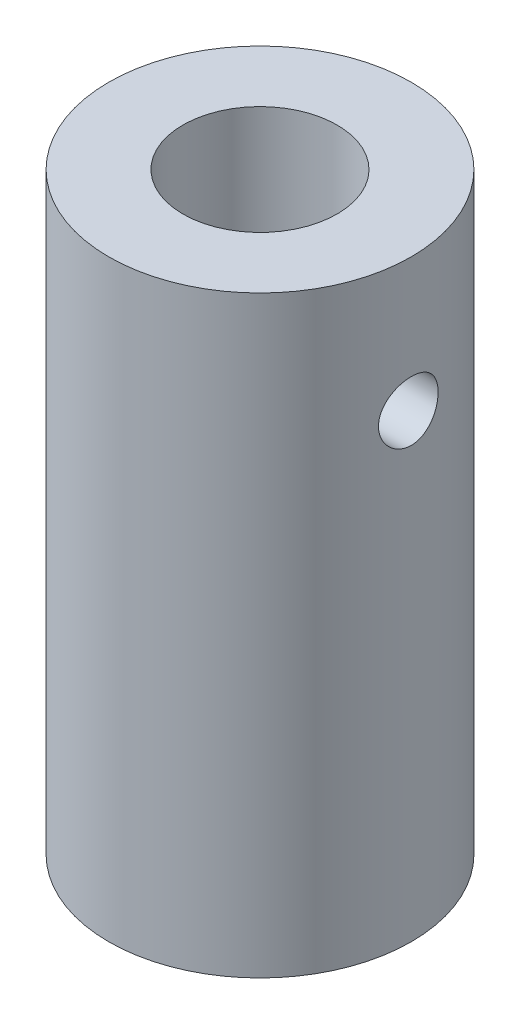
ISO-10303-21;
HEADER;
FILE_DESCRIPTION(('STEP AP214'),'2;1');
FILE_NAME('part.step','',(''),(''),'','','');
FILE_SCHEMA(('AUTOMOTIVE_DESIGN { 1 0 10303 214 1 1 1 1 }'));
ENDSEC;
DATA;
#1=APPLICATION_CONTEXT('core data for automotive mechanical design processes');
#2=APPLICATION_PROTOCOL_DEFINITION('international standard','automotive_design',2000,#1);
#3=PRODUCT_CONTEXT('',#1,'mechanical');
#4=PRODUCT('Part','Part','',(#3));
#5=PRODUCT_RELATED_PRODUCT_CATEGORY('part','',(#4));
#6=PRODUCT_DEFINITION_FORMATION('','',#4);
#7=PRODUCT_DEFINITION_CONTEXT('part definition',#1,'design');
#8=PRODUCT_DEFINITION('design','',#6,#7);
#9=PRODUCT_DEFINITION_SHAPE('','',#8);
#10=(LENGTH_UNIT() NAMED_UNIT(*) SI_UNIT(.MILLI.,.METRE.));
#11=(NAMED_UNIT(*) PLANE_ANGLE_UNIT() SI_UNIT($,.RADIAN.));
#12=(NAMED_UNIT(*) SI_UNIT($,.STERADIAN.) SOLID_ANGLE_UNIT());
#13=UNCERTAINTY_MEASURE_WITH_UNIT(LENGTH_MEASURE(1.E-05),#10,'distance_accuracy_value','');
#14=(GEOMETRIC_REPRESENTATION_CONTEXT(3) GLOBAL_UNCERTAINTY_ASSIGNED_CONTEXT((#13)) GLOBAL_UNIT_ASSIGNED_CONTEXT((#10,
#11,#12)) REPRESENTATION_CONTEXT('',''));
#15=CARTESIAN_POINT('',(0.,0.,0.));
#16=DIRECTION('',(0.,0.,1.));
#17=DIRECTION('',(1.,0.,0.));
#18=AXIS2_PLACEMENT_3D('',#15,#16,#17);
#19=CARTESIAN_POINT('',(0.,50.8,0.));
#20=DIRECTION('',(0.,1.,0.));
#21=DIRECTION('',(0.,0.,1.));
#22=AXIS2_PLACEMENT_3D('',#19,#20,#21);
#23=PLANE('',#22);
#24=CARTESIAN_POINT('',(0.,50.8,0.));
#25=DIRECTION('',(0.,1.,0.));
#26=DIRECTION('',(0.,0.,1.));
#27=AXIS2_PLACEMENT_3D('',#24,#25,#26);
#28=CIRCLE('',#27,12.954);
#29=CARTESIAN_POINT('',(0.,50.8,12.954));
#30=VERTEX_POINT('',#29);
#31=EDGE_CURVE('E10',#30,#30,#28,.T.);
#32=ORIENTED_EDGE('',*,*,#31,.T.);
#33=EDGE_LOOP('',(#32));
#34=FACE_BOUND('',#33,.T.);
#35=CARTESIAN_POINT('',(0.,50.8,0.));
#36=DIRECTION('',(0.,1.,0.));
#37=DIRECTION('',(0.,0.,1.));
#38=AXIS2_PLACEMENT_3D('',#35,#36,#37);
#39=CIRCLE('',#38,6.604);
#40=CARTESIAN_POINT('',(0.,50.8,6.604));
#41=VERTEX_POINT('',#40);
#42=EDGE_CURVE('E61',#41,#41,#39,.T.);
#43=ORIENTED_EDGE('',*,*,#42,.F.);
#44=EDGE_LOOP('',(#43));
#45=FACE_BOUND('',#44,.T.);
#46=ADVANCED_FACE('F47',(#34,#45),#23,.T.);
#47=CARTESIAN_POINT('',(0.,0.,0.));
#48=DIRECTION('',(0.,1.,0.));
#49=DIRECTION('',(0.,0.,1.));
#50=AXIS2_PLACEMENT_3D('',#47,#48,#49);
#51=PLANE('',#50);
#52=CARTESIAN_POINT('',(0.,0.,0.));
#53=DIRECTION('',(0.,1.,0.));
#54=DIRECTION('',(0.,0.,1.));
#55=AXIS2_PLACEMENT_3D('',#52,#53,#54);
#56=CIRCLE('',#55,12.954);
#57=CARTESIAN_POINT('',(0.,0.,12.954));
#58=VERTEX_POINT('',#57);
#59=EDGE_CURVE('E51',#58,#58,#56,.T.);
#60=ORIENTED_EDGE('',*,*,#59,.F.);
#61=EDGE_LOOP('',(#60));
#62=FACE_BOUND('',#61,.T.);
#63=CARTESIAN_POINT('',(0.,0.,0.));
#64=DIRECTION('',(0.,1.,0.));
#65=DIRECTION('',(0.,0.,1.));
#66=AXIS2_PLACEMENT_3D('',#63,#64,#65);
#67=CIRCLE('',#66,6.604);
#68=CARTESIAN_POINT('',(0.,0.,6.604));
#69=VERTEX_POINT('',#68);
#70=EDGE_CURVE('E63',#69,#69,#67,.T.);
#71=ORIENTED_EDGE('',*,*,#70,.T.);
#72=EDGE_LOOP('',(#71));
#73=FACE_BOUND('',#72,.T.);
#74=ADVANCED_FACE('F99',(#62,#73),#51,.F.);
#75=CARTESIAN_POINT('',(0.,50.8,0.));
#76=DIRECTION('',(0.,-1.,0.));
#77=DIRECTION('',(0.,0.,-1.));
#78=AXIS2_PLACEMENT_3D('',#75,#76,#77);
#79=CYLINDRICAL_SURFACE('',#78,12.954);
#80=CARTESIAN_POINT('',(12.6999936499984,39.37,2.5527));
#81=CARTESIAN_POINT('',(12.6999964560656,39.5118846038993,2.55269470529488));
#82=CARTESIAN_POINT('',(12.7023972007292,39.6538363709703,2.54083045244426));
#83=CARTESIAN_POINT('',(12.711727198339,39.9337273193116,2.49372464143787));
#84=CARTESIAN_POINT('',(12.7186601271798,40.071663148459,2.45846410703602));
#85=CARTESIAN_POINT('',(12.7362394967447,40.3394323066131,2.36569894641199));
#86=CARTESIAN_POINT('',(12.7468822994527,40.4692734270284,2.3082161060649));
#87=CARTESIAN_POINT('',(12.7706779198386,40.7174641353506,2.17269724505164));
#88=CARTESIAN_POINT('',(12.783830584046,40.8358144252202,2.09466248096343));
#89=CARTESIAN_POINT('',(12.8113657262031,41.0592959784291,1.91911261103482));
#90=CARTESIAN_POINT('',(12.8257613551746,41.1642464900658,1.82136942807505));
#91=CARTESIAN_POINT('',(12.8540445578265,41.3563720946631,1.60967010492994));
#92=CARTESIAN_POINT('',(12.8679320963932,41.4435459609883,1.49571284685128));
#93=CARTESIAN_POINT('',(12.8937759771519,41.598343015845,1.25362558079212));
#94=CARTESIAN_POINT('',(12.9057150074278,41.6657947601989,1.12538394028595));
#95=CARTESIAN_POINT('',(12.9261690621922,41.7781269800485,0.859113331705537));
#96=CARTESIAN_POINT('',(12.9346843977458,41.8230095061994,0.721085254134684));
#97=CARTESIAN_POINT('',(12.9472387117929,41.8883674635948,0.441035057662935));
#98=CARTESIAN_POINT('',(12.9513336004,41.9091479952259,0.29908669096931));
#99=CARTESIAN_POINT('',(12.9547786408718,41.926663678721,0.0136632800686853));
#100=CARTESIAN_POINT('',(12.9541292371467,41.9234010827667,-0.129811619886808));
#101=CARTESIAN_POINT('',(12.9482022753918,41.8931551538447,-0.412119865872245));
#102=CARTESIAN_POINT('',(12.9429888352255,41.8665004323829,-0.550989960317775));
#103=CARTESIAN_POINT('',(12.9285917985172,41.7907477457311,-0.822246914749961));
#104=CARTESIAN_POINT('',(12.9194080464398,41.7416489012967,-0.954633520522146));
#105=CARTESIAN_POINT('',(12.8979962445554,41.6220951903056,-1.2101067652594));
#106=CARTESIAN_POINT('',(12.8857498352859,41.5515109518044,-1.33313126044891));
#107=CARTESIAN_POINT('',(12.8595637882297,41.3910857126889,-1.56571168746213));
#108=CARTESIAN_POINT('',(12.8456239611097,41.3012425579619,-1.67526611049739));
#109=CARTESIAN_POINT('',(12.8173134588381,41.1030451135238,-1.87974593617272));
#110=CARTESIAN_POINT('',(12.8029394847352,40.9944032553083,-1.97439235586856));
#111=CARTESIAN_POINT('',(12.775604938468,40.7626449639737,-2.14416676141107));
#112=CARTESIAN_POINT('',(12.7626443915042,40.6395282728606,-2.21929439928557));
#113=CARTESIAN_POINT('',(12.7395980543948,40.3819219011779,-2.34799082660807));
#114=CARTESIAN_POINT('',(12.7295181499613,40.2474096536186,-2.40151556779307));
#115=CARTESIAN_POINT('',(12.7134615964999,39.9710569493192,-2.48512393860867));
#116=CARTESIAN_POINT('',(12.7074844296736,39.8292174197715,-2.51521052638726));
#117=CARTESIAN_POINT('',(12.7004135327466,39.5447619057547,-2.5506739071257));
#118=CARTESIAN_POINT('',(12.6992402886649,39.4021980082035,-2.55645307787584));
#119=CARTESIAN_POINT('',(12.7016967998167,39.118143008791,-2.54421933773806));
#120=CARTESIAN_POINT('',(12.705326291143,38.9766518484131,-2.52620773413736));
#121=CARTESIAN_POINT('',(12.7169049541452,38.7001040816553,-2.46725027235019));
#122=CARTESIAN_POINT('',(12.7248137949063,38.5650000069211,-2.42651843299844));
#123=CARTESIAN_POINT('',(12.7440248133199,38.3035339393909,-2.32350514279095));
#124=CARTESIAN_POINT('',(12.7553272635043,38.1771726497085,-2.26122196114165));
#125=CARTESIAN_POINT('',(12.780231221071,37.9350155031722,-2.11595946421157));
#126=CARTESIAN_POINT('',(12.7938600574193,37.8193738926915,-2.03272779151052));
#127=CARTESIAN_POINT('',(12.8218057253165,37.6035522990143,-1.84826828051531));
#128=CARTESIAN_POINT('',(12.836122625406,37.5033738603653,-1.74703864665502));
#129=CARTESIAN_POINT('',(12.8640887181811,37.3198020866866,-1.52765261367294));
#130=CARTESIAN_POINT('',(12.8777248180054,37.236680467357,-1.40926691821333));
#131=CARTESIAN_POINT('',(12.9025670030226,37.0915068065751,-1.15997764592574));
#132=CARTESIAN_POINT('',(12.9137731883081,37.0294538972054,-1.02907458503057));
#133=CARTESIAN_POINT('',(12.9324369088285,36.9285777355193,-0.759189484808883));
#134=CARTESIAN_POINT('',(12.9399152469174,36.8896253365008,-0.620257219565459));
#135=CARTESIAN_POINT('',(12.9503697771678,36.8356459785038,-0.337659988307553));
#136=CARTESIAN_POINT('',(12.9533464949998,36.8206162259794,-0.193995576885377));
#137=CARTESIAN_POINT('',(12.9544504356144,36.8150143643972,0.0913900104214483));
#138=CARTESIAN_POINT('',(12.9526587483563,36.8240332961505,0.233103005005912));
#139=CARTESIAN_POINT('',(12.9445972082044,36.8653715667451,0.512951899858711));
#140=CARTESIAN_POINT('',(12.9383274082796,36.8976906299818,0.651087842418041));
#141=CARTESIAN_POINT('',(12.9220158544874,36.9845322143373,0.919615930903082));
#142=CARTESIAN_POINT('',(12.911982223707,37.0390069403518,1.05002405810271));
#143=CARTESIAN_POINT('',(12.8892247597301,37.1685624806085,1.2999083253577));
#144=CARTESIAN_POINT('',(12.8765007215965,37.2436448647333,1.41938363163051));
#145=CARTESIAN_POINT('',(12.8495107406611,37.4136707178677,1.64603672705227));
#146=CARTESIAN_POINT('',(12.8352237285662,37.5089074641959,1.75299202749085));
#147=CARTESIAN_POINT('',(12.8068450323962,37.7159345748501,1.94954408581376));
#148=CARTESIAN_POINT('',(12.7927533952898,37.8277288466939,2.03913673462033));
#149=CARTESIAN_POINT('',(12.7661998829505,38.0660914332319,2.19930312367454));
#150=CARTESIAN_POINT('',(12.7537564796432,38.1928012949769,2.26966939593184));
#151=CARTESIAN_POINT('',(12.7321331027171,38.4564540821596,2.38800128130351));
#152=CARTESIAN_POINT('',(12.7229501415081,38.5933874996025,2.43598741437484));
#153=CARTESIAN_POINT('',(12.7107401829196,38.8372116673781,2.49878370236449));
#154=CARTESIAN_POINT('',(12.7067349563873,38.9427026033387,2.51896650723778));
#155=CARTESIAN_POINT('',(12.7013606719411,39.1554495955357,2.54592643933515));
#156=CARTESIAN_POINT('',(12.6999915280253,39.2627055940721,2.55270400390334));
#157=CARTESIAN_POINT('',(12.6999936499984,39.37,2.5527));
#158=B_SPLINE_CURVE_WITH_KNOTS('',3,(#80,#81,#82,#83,#84,#85,#86,#87,#88,#89,#90,#91,#92,#93,
#94,#95,#96,#97,#98,#99,#100,#101,#102,#103,#104,#105,#106,#107,#108,#109,#110,#111,#112,#113,
#114,#115,#116,#117,#118,#119,#120,#121,#122,#123,#124,#125,#126,#127,#128,#129,#130,#131,#132,
#133,#134,#135,#136,#137,#138,#139,#140,#141,#142,#143,#144,#145,#146,#147,#148,#149,#150,#151,
#152,#153,#154,#155,#156,#157),.UNSPECIFIED.,.T.,.F.,(4,2,2,2,2,2,2,2,2,2,2,2,2,2,2,2,2,2,2,2,2,
2,2,2,2,2,2,2,2,2,2,2,2,2,2,2,2,2,4),(0.,0.425261007666672,0.850867358163517,1.27605751472451,
1.70122168050208,2.13162201908685,2.56205204638439,2.9961195455948,3.43014759799418,
3.85861928655146,4.28705083957021,4.70955844948326,5.13208261247473,5.55720304823211,
5.98237105861164,6.41473513711059,6.84710692307495,7.28035591369378,7.71355021475017,
8.13954461366788,8.56551560545061,8.98754021680916,9.40959872893701,9.83700771735127,
10.2644593701634,10.6982665816013,11.1320559203502,11.5633966594628,11.9946870254441,
12.4186900669991,12.8426880933334,13.2657762646093,13.6888966755094,14.1186592390795,
14.5485233871912,14.9828577313365,15.4167930552262,15.73838972331,16.0599758991737),.UNSPECIFIED.);
#159=CARTESIAN_POINT('',(12.6999936499984,39.37,2.5527));
#160=VERTEX_POINT('',#159);
#161=EDGE_CURVE('E79',#160,#160,#158,.T.);
#162=ORIENTED_EDGE('',*,*,#161,.T.);
#163=EDGE_LOOP('',(#162));
#164=FACE_BOUND('',#163,.T.);
#165=ORIENTED_EDGE('',*,*,#31,.F.);
#166=EDGE_LOOP('',(#165));
#167=FACE_BOUND('',#166,.T.);
#168=ORIENTED_EDGE('',*,*,#59,.T.);
#169=EDGE_LOOP('',(#168));
#170=FACE_BOUND('',#169,.T.);
#171=ADVANCED_FACE('F49',(#164,#167,#170),#79,.T.);
#172=CARTESIAN_POINT('',(0.,50.8,0.));
#173=DIRECTION('',(0.,-1.,0.));
#174=DIRECTION('',(0.,0.,-1.));
#175=AXIS2_PLACEMENT_3D('',#172,#173,#174);
#176=CYLINDRICAL_SURFACE('',#175,6.604);
#177=CARTESIAN_POINT('',(6.09069279392747,39.37,2.5527));
#178=CARTESIAN_POINT('',(6.09068621282821,39.5075038315529,2.55270681708154));
#179=CARTESIAN_POINT('',(6.09539960938205,39.6449644848225,2.54155315657549));
#180=CARTESIAN_POINT('',(6.11360032490419,39.9157209334737,2.49745315471047));
#181=CARTESIAN_POINT('',(6.12708697395381,40.049017046042,2.4645084772932));
#182=CARTESIAN_POINT('',(6.16108304331434,40.3074505314335,2.3782326648086));
#183=CARTESIAN_POINT('',(6.18157466982632,40.4326076291685,2.32495314404245));
#184=CARTESIAN_POINT('',(6.2272422726624,40.6722566550951,2.19970442142836));
#185=CARTESIAN_POINT('',(6.25241974380341,40.7867451623935,2.12772925263199));
#186=CARTESIAN_POINT('',(6.30611326198978,41.0078617337476,1.96305645407738));
#187=CARTESIAN_POINT('',(6.33473164494139,41.1138468028968,1.869528577533));
#188=CARTESIAN_POINT('',(6.39123170912992,41.3090852430119,1.66616381683389));
#189=CARTESIAN_POINT('',(6.41911321902346,41.3983347513964,1.55632317813711));
#190=CARTESIAN_POINT('',(6.47222405707365,41.5607208728981,1.31851673394261));
#191=CARTESIAN_POINT('',(6.49731955217189,41.633151026134,1.19003594680584));
#192=CARTESIAN_POINT('',(6.54079315590887,41.7550989812725,0.921570324410838));
#193=CARTESIAN_POINT('',(6.55917375118815,41.8046252666735,0.7815897712792));
#194=CARTESIAN_POINT('',(6.58641948007611,41.8770818147634,0.50086333046182));
#195=CARTESIAN_POINT('',(6.59567989287745,41.9011207296475,0.360442711663769));
#196=CARTESIAN_POINT('',(6.60506504241823,41.925480493152,0.0772754298679294));
#197=CARTESIAN_POINT('',(6.6051929358593,41.9258095372097,-0.0654704123397355));
#198=CARTESIAN_POINT('',(6.5965450963769,41.90336859363,-0.341259417909293));
#199=CARTESIAN_POINT('',(6.58823657331197,41.8818107146922,-0.474418456132941));
#200=CARTESIAN_POINT('',(6.56426996700342,41.8182571730305,-0.735058997143683));
#201=CARTESIAN_POINT('',(6.54861136021126,41.776260054406,-0.86254009478111));
#202=CARTESIAN_POINT('',(6.51119531022126,41.6724972866825,-1.11045701171783));
#203=CARTESIAN_POINT('',(6.4893508879652,41.6104477819578,-1.23076035677158));
#204=CARTESIAN_POINT('',(6.44175438635462,41.4685992067446,-1.45955196693056));
#205=CARTESIAN_POINT('',(6.41600100712455,41.3887942277644,-1.56803628107159));
#206=CARTESIAN_POINT('',(6.36134442201025,41.2079436418402,-1.77722162899958));
#207=CARTESIAN_POINT('',(6.33234491477186,41.1058902975108,-1.87702758741377));
#208=CARTESIAN_POINT('',(6.27571623201433,40.8863475520008,-2.05845943882603));
#209=CARTESIAN_POINT('',(6.24808744800365,40.7688537752636,-2.14008016069785));
#210=CARTESIAN_POINT('',(6.19669941796012,40.5180213232122,-2.28468519126654));
#211=CARTESIAN_POINT('',(6.17305344983382,40.3843613456105,-2.34715572928594));
#212=CARTESIAN_POINT('',(6.13362520156208,40.1072620921077,-2.44835514308008));
#213=CARTESIAN_POINT('',(6.11783821628932,39.9638287261021,-2.48709822755019));
#214=CARTESIAN_POINT('',(6.0970397478806,39.680140563089,-2.53764278879261));
#215=CARTESIAN_POINT('',(6.09145701050638,39.5401829905236,-2.55087499741354));
#216=CARTESIAN_POINT('',(6.09007707975142,39.2599665148702,-2.55417066387378));
#217=CARTESIAN_POINT('',(6.09427721367103,39.1197077045404,-2.54424044973138));
#218=CARTESIAN_POINT('',(6.11140677376506,38.8504789218981,-2.5027930102615));
#219=CARTESIAN_POINT('',(6.12387378919034,38.7213001709133,-2.47241807926171));
#220=CARTESIAN_POINT('',(6.15557247748963,38.4699436297376,-2.39240086894677));
#221=CARTESIAN_POINT('',(6.17480558827011,38.3477673341067,-2.34275449390093));
#222=CARTESIAN_POINT('',(6.21878867175937,38.1085852182474,-2.22343537435663));
#223=CARTESIAN_POINT('',(6.2437243430497,37.9919661252229,-2.15305793986463));
#224=CARTESIAN_POINT('',(6.29600416605923,37.7716877491209,-1.99501063605528));
#225=CARTESIAN_POINT('',(6.3233492434711,37.6680334844558,-1.90733410425936));
#226=CARTESIAN_POINT('',(6.37961642965596,37.4692976495307,-1.71011943311713));
#227=CARTESIAN_POINT('',(6.40851911463939,37.3752806281864,-1.59949911020722));
#228=CARTESIAN_POINT('',(6.46287512348568,37.2069994685588,-1.36334991835795));
#229=CARTESIAN_POINT('',(6.48832838121021,37.1327357089929,-1.23782076364741));
#230=CARTESIAN_POINT('',(6.5329415439821,37.0064691862802,-0.975275191471114));
#231=CARTESIAN_POINT('',(6.55211462380479,36.9544197506972,-0.838283588718474));
#232=CARTESIAN_POINT('',(6.58202564232317,36.8744209495949,-0.556572503640253));
#233=CARTESIAN_POINT('',(6.59276782507944,36.846459457663,-0.411856948739287));
#234=CARTESIAN_POINT('',(6.60418133752458,36.8167980668114,-0.128398059883316));
#235=CARTESIAN_POINT('',(6.60543126433803,36.8135891782394,0.0101653919238167));
#236=CARTESIAN_POINT('',(6.59925278493014,36.8295955415817,0.285779132356688));
#237=CARTESIAN_POINT('',(6.59182553876139,36.8488077960097,0.422829620778312));
#238=CARTESIAN_POINT('',(6.56940334652294,36.9080413748172,0.687724413849724));
#239=CARTESIAN_POINT('',(6.55461971007859,36.9474825519319,0.81571772538089));
#240=CARTESIAN_POINT('',(6.51904407901005,37.0454625688309,1.0632658129641));
#241=CARTESIAN_POINT('',(6.49825094721588,37.1040050233988,1.18281898656586));
#242=CARTESIAN_POINT('',(6.45160341138416,37.2413869225641,1.41575023401873));
#243=CARTESIAN_POINT('',(6.42556937434411,37.3209929675384,1.52863948421796));
#244=CARTESIAN_POINT('',(6.37161112525947,37.4970593155567,1.73991298994868));
#245=CARTESIAN_POINT('',(6.34368622560918,37.5935257702139,1.83829192707248));
#246=CARTESIAN_POINT('',(6.2871346082334,37.8070865273155,2.02352874381926));
#247=CARTESIAN_POINT('',(6.25855830161905,37.9250419786097,2.10941316253562));
#248=CARTESIAN_POINT('',(6.20569541878587,38.1746046477747,2.2602141927555));
#249=CARTESIAN_POINT('',(6.18140982233102,38.3062149728115,2.32512601806054));
#250=CARTESIAN_POINT('',(6.13880768999663,38.589418882148,2.43549649348975));
#251=CARTESIAN_POINT('',(6.12103554303053,38.7417675723894,2.47925234379172));
#252=CARTESIAN_POINT('',(6.09698639869994,39.0527666822511,2.53783882058201));
#253=CARTESIAN_POINT('',(6.09070038413767,39.2114120585905,2.55269213762325));
#254=CARTESIAN_POINT('',(6.09069279392747,39.37,2.5527));
#255=B_SPLINE_CURVE_WITH_KNOTS('',3,(#177,#178,#179,#180,#181,#182,#183,#184,#185,#186,#187,
#188,#189,#190,#191,#192,#193,#194,#195,#196,#197,#198,#199,#200,#201,#202,#203,#204,#205,#206,
#207,#208,#209,#210,#211,#212,#213,#214,#215,#216,#217,#218,#219,#220,#221,#222,#223,#224,#225,
#226,#227,#228,#229,#230,#231,#232,#233,#234,#235,#236,#237,#238,#239,#240,#241,#242,#243,#244,
#245,#246,#247,#248,#249,#250,#251,#252,#253,#254),.UNSPECIFIED.,.T.,.F.,(4,2,2,2,2,2,2,2,2,2,2,
2,2,2,2,2,2,2,2,2,2,2,2,2,2,2,2,2,2,2,2,2,2,2,2,2,2,2,4),(0.,0.411920034108599,
0.823808618018666,1.23465861710465,1.64563990553941,2.07638995640906,2.50723930271205,
2.95380392069247,3.40020300023691,3.82626939768612,4.25218852241135,4.65574104913302,
5.05932232537889,5.46888707129315,5.87858831252532,6.3136040832257,6.74874339691938,
7.19470077706827,7.64039084306275,8.06026164987235,8.48001776060906,8.8780779844535,
9.27622285379164,9.68987501102531,10.1036867920309,10.5456798915993,10.9876814646202,
11.4287497625532,11.8695958868129,12.2833365605433,12.6970219275487,13.0994564425957,
13.501967159784,13.9218405847824,14.3418675239234,14.7857829026293,15.2297995167334,
15.7052546060214,16.180336278269),.UNSPECIFIED.);
#256=CARTESIAN_POINT('',(6.09069279392747,39.37,2.5527));
#257=VERTEX_POINT('',#256);
#258=EDGE_CURVE('E67',#257,#257,#255,.T.);
#259=ORIENTED_EDGE('',*,*,#258,.F.);
#260=EDGE_LOOP('',(#259));
#261=FACE_BOUND('',#260,.T.);
#262=ORIENTED_EDGE('',*,*,#42,.T.);
#263=EDGE_LOOP('',(#262));
#264=FACE_BOUND('',#263,.T.);
#265=ORIENTED_EDGE('',*,*,#70,.F.);
#266=EDGE_LOOP('',(#265));
#267=FACE_BOUND('',#266,.T.);
#268=ADVANCED_FACE('F84',(#261,#264,#267),#176,.F.);
#269=CARTESIAN_POINT('',(0.,39.37,0.));
#270=DIRECTION('',(-1.,0.,0.));
#271=DIRECTION('',(0.,0.,1.));
#272=AXIS2_PLACEMENT_3D('',#269,#270,#271);
#273=CYLINDRICAL_SURFACE('',#272,2.5527);
#274=ORIENTED_EDGE('',*,*,#258,.T.);
#275=EDGE_LOOP('',(#274));
#276=FACE_BOUND('',#275,.T.);
#277=ORIENTED_EDGE('',*,*,#161,.F.);
#278=EDGE_LOOP('',(#277));
#279=FACE_BOUND('',#278,.T.);
#280=ADVANCED_FACE('F87',(#276,#279),#273,.F.);
#281=CLOSED_SHELL('',(#46,#74,#171,#268,#280));
#282=MANIFOLD_SOLID_BREP('B2',#281);
#283=ADVANCED_BREP_SHAPE_REPRESENTATION('',(#18,#282),#14);
#284=SHAPE_DEFINITION_REPRESENTATION(#9,#283);
ENDSEC;
END-ISO-10303-21;
